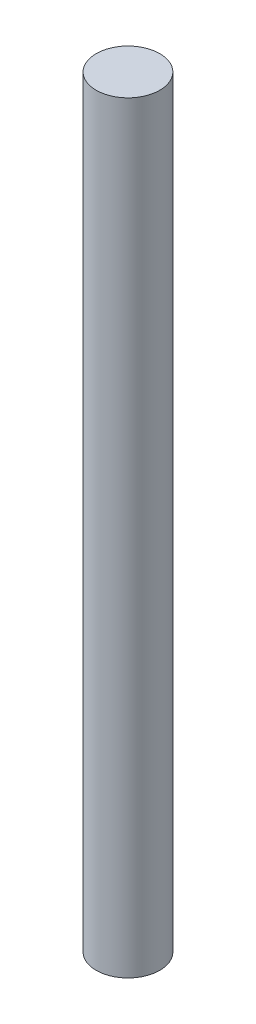
ISO-10303-21;
HEADER;
FILE_DESCRIPTION(('STEP AP214'),'2;1');
FILE_NAME('part.step','',(''),(''),'','','');
FILE_SCHEMA(('AUTOMOTIVE_DESIGN { 1 0 10303 214 1 1 1 1 }'));
ENDSEC;
DATA;
#1=APPLICATION_CONTEXT('core data for automotive mechanical design processes');
#2=APPLICATION_PROTOCOL_DEFINITION('international standard','automotive_design',2000,#1);
#3=PRODUCT_CONTEXT('',#1,'mechanical');
#4=PRODUCT('Part','Part','',(#3));
#5=PRODUCT_RELATED_PRODUCT_CATEGORY('part','',(#4));
#6=PRODUCT_DEFINITION_FORMATION('','',#4);
#7=PRODUCT_DEFINITION_CONTEXT('part definition',#1,'design');
#8=PRODUCT_DEFINITION('design','',#6,#7);
#9=PRODUCT_DEFINITION_SHAPE('','',#8);
#10=(LENGTH_UNIT() NAMED_UNIT(*) SI_UNIT(.MILLI.,.METRE.));
#11=(NAMED_UNIT(*) PLANE_ANGLE_UNIT() SI_UNIT($,.RADIAN.));
#12=(NAMED_UNIT(*) SI_UNIT($,.STERADIAN.) SOLID_ANGLE_UNIT());
#13=UNCERTAINTY_MEASURE_WITH_UNIT(LENGTH_MEASURE(1.E-05),#10,'distance_accuracy_value','');
#14=(GEOMETRIC_REPRESENTATION_CONTEXT(3) GLOBAL_UNCERTAINTY_ASSIGNED_CONTEXT((#13)) GLOBAL_UNIT_ASSIGNED_CONTEXT((#10,
#11,#12)) REPRESENTATION_CONTEXT('',''));
#15=CARTESIAN_POINT('',(0.,0.,0.));
#16=DIRECTION('',(0.,0.,1.));
#17=DIRECTION('',(1.,0.,0.));
#18=AXIS2_PLACEMENT_3D('',#15,#16,#17);
#19=CARTESIAN_POINT('',(0.,45.,0.));
#20=DIRECTION('',(0.,-1.,0.));
#21=DIRECTION('',(0.,0.,-1.));
#22=AXIS2_PLACEMENT_3D('',#19,#20,#21);
#23=CYLINDRICAL_SURFACE('',#22,1.875);
#24=CARTESIAN_POINT('',(0.,45.,0.));
#25=DIRECTION('',(0.,1.,0.));
#26=DIRECTION('',(0.,0.,1.));
#27=AXIS2_PLACEMENT_3D('',#24,#25,#26);
#28=CIRCLE('',#27,1.875);
#29=CARTESIAN_POINT('',(0.,45.,1.875));
#30=VERTEX_POINT('',#29);
#31=EDGE_CURVE('E10',#30,#30,#28,.T.);
#32=ORIENTED_EDGE('',*,*,#31,.F.);
#33=EDGE_LOOP('',(#32));
#34=FACE_BOUND('',#33,.T.);
#35=CARTESIAN_POINT('',(0.,0.,0.));
#36=DIRECTION('',(0.,1.,0.));
#37=DIRECTION('',(0.,0.,1.));
#38=AXIS2_PLACEMENT_3D('',#35,#36,#37);
#39=CIRCLE('',#38,1.875);
#40=CARTESIAN_POINT('',(0.,0.,1.875));
#41=VERTEX_POINT('',#40);
#42=EDGE_CURVE('E37',#41,#41,#39,.T.);
#43=ORIENTED_EDGE('',*,*,#42,.T.);
#44=EDGE_LOOP('',(#43));
#45=FACE_BOUND('',#44,.T.);
#46=ADVANCED_FACE('F34',(#34,#45),#23,.T.);
#47=CARTESIAN_POINT('',(0.,45.,0.));
#48=DIRECTION('',(0.,1.,0.));
#49=DIRECTION('',(0.,0.,1.));
#50=AXIS2_PLACEMENT_3D('',#47,#48,#49);
#51=PLANE('',#50);
#52=ORIENTED_EDGE('',*,*,#31,.T.);
#53=EDGE_LOOP('',(#52));
#54=FACE_BOUND('',#53,.T.);
#55=ADVANCED_FACE('F49',(#54),#51,.T.);
#56=CARTESIAN_POINT('',(0.,0.,0.));
#57=DIRECTION('',(0.,1.,0.));
#58=DIRECTION('',(0.,0.,1.));
#59=AXIS2_PLACEMENT_3D('',#56,#57,#58);
#60=PLANE('',#59);
#61=ORIENTED_EDGE('',*,*,#42,.F.);
#62=EDGE_LOOP('',(#61));
#63=FACE_BOUND('',#62,.T.);
#64=ADVANCED_FACE('F47',(#63),#60,.F.);
#65=CLOSED_SHELL('',(#46,#55,#64));
#66=MANIFOLD_SOLID_BREP('B2',#65);
#67=ADVANCED_BREP_SHAPE_REPRESENTATION('',(#18,#66),#14);
#68=SHAPE_DEFINITION_REPRESENTATION(#9,#67);
ENDSEC;
END-ISO-10303-21;
